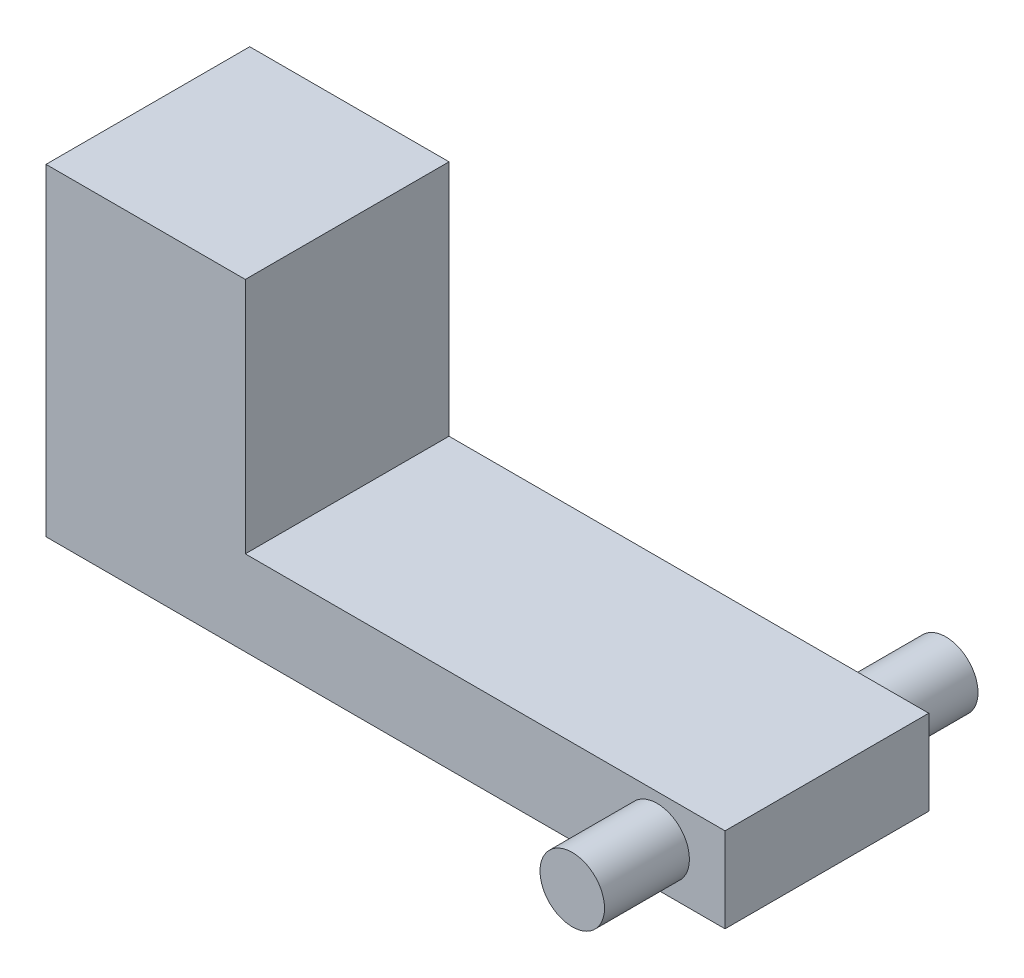
ISO-10303-21;
HEADER;
FILE_DESCRIPTION(('STEP AP214'),'2;1');
FILE_NAME('part.step','',(''),(''),'','','');
FILE_SCHEMA(('AUTOMOTIVE_DESIGN { 1 0 10303 214 1 1 1 1 }'));
ENDSEC;
DATA;
#1=APPLICATION_CONTEXT('core data for automotive mechanical design processes');
#2=APPLICATION_PROTOCOL_DEFINITION('international standard','automotive_design',2000,#1);
#3=PRODUCT_CONTEXT('',#1,'mechanical');
#4=PRODUCT('Part','Part','',(#3));
#5=PRODUCT_RELATED_PRODUCT_CATEGORY('part','',(#4));
#6=PRODUCT_DEFINITION_FORMATION('','',#4);
#7=PRODUCT_DEFINITION_CONTEXT('part definition',#1,'design');
#8=PRODUCT_DEFINITION('design','',#6,#7);
#9=PRODUCT_DEFINITION_SHAPE('','',#8);
#10=(LENGTH_UNIT() NAMED_UNIT(*) SI_UNIT(.MILLI.,.METRE.));
#11=(NAMED_UNIT(*) PLANE_ANGLE_UNIT() SI_UNIT($,.RADIAN.));
#12=(NAMED_UNIT(*) SI_UNIT($,.STERADIAN.) SOLID_ANGLE_UNIT());
#13=UNCERTAINTY_MEASURE_WITH_UNIT(LENGTH_MEASURE(1.E-05),#10,'distance_accuracy_value','');
#14=(GEOMETRIC_REPRESENTATION_CONTEXT(3) GLOBAL_UNCERTAINTY_ASSIGNED_CONTEXT((#13)) GLOBAL_UNIT_ASSIGNED_CONTEXT((#10,
#11,#12)) REPRESENTATION_CONTEXT('',''));
#15=CARTESIAN_POINT('',(0.,0.,0.));
#16=DIRECTION('',(0.,0.,1.));
#17=DIRECTION('',(1.,0.,0.));
#18=AXIS2_PLACEMENT_3D('',#15,#16,#17);
#19=CARTESIAN_POINT('',(0.,2.5,0.));
#20=DIRECTION('',(0.,-1.,0.));
#21=DIRECTION('',(0.,0.,-1.));
#22=AXIS2_PLACEMENT_3D('',#19,#20,#21);
#23=PLANE('',#22);
#24=DIRECTION('',(0.,0.,-1.));
#25=VECTOR('',#24,1.);
#26=CARTESIAN_POINT('',(-4.13008694887129,2.5,3.));
#27=LINE('',#26,#25);
#28=CARTESIAN_POINT('',(-4.13008694887129,2.5,3.));
#29=VERTEX_POINT('',#28);
#30=CARTESIAN_POINT('',(-4.13008694887129,2.5,-3.));
#31=VERTEX_POINT('',#30);
#32=EDGE_CURVE('E49',#29,#31,#27,.T.);
#33=ORIENTED_EDGE('',*,*,#32,.F.);
#34=DIRECTION('',(1.,0.,0.));
#35=VECTOR('',#34,1.);
#36=CARTESIAN_POINT('',(-10.,2.5,3.));
#37=LINE('',#36,#35);
#38=CARTESIAN_POINT('',(10.,2.5,3.));
#39=VERTEX_POINT('',#38);
#40=EDGE_CURVE('E54',#29,#39,#37,.T.);
#41=ORIENTED_EDGE('',*,*,#40,.T.);
#42=DIRECTION('',(0.,0.,-1.));
#43=VECTOR('',#42,1.);
#44=CARTESIAN_POINT('',(10.,2.5,3.));
#45=LINE('',#44,#43);
#46=CARTESIAN_POINT('',(10.,2.5,-3.));
#47=VERTEX_POINT('',#46);
#48=EDGE_CURVE('E85',#39,#47,#45,.T.);
#49=ORIENTED_EDGE('',*,*,#48,.T.);
#50=DIRECTION('',(-1.,0.,0.));
#51=VECTOR('',#50,1.);
#52=CARTESIAN_POINT('',(-10.,2.5,-3.));
#53=LINE('',#52,#51);
#54=EDGE_CURVE('E145',#47,#31,#53,.T.);
#55=ORIENTED_EDGE('',*,*,#54,.T.);
#56=EDGE_LOOP('',(#33,#41,#49,#55));
#57=FACE_BOUND('',#56,.T.);
#58=ADVANCED_FACE('F33',(#57),#23,.F.);
#59=CARTESIAN_POINT('',(10.,2.5,3.));
#60=DIRECTION('',(-1.,0.,0.));
#61=DIRECTION('',(0.,0.,1.));
#62=AXIS2_PLACEMENT_3D('',#59,#60,#61);
#63=PLANE('',#62);
#64=DIRECTION('',(0.,0.,-1.));
#65=VECTOR('',#64,1.);
#66=CARTESIAN_POINT('',(10.,0.,3.));
#67=LINE('',#66,#65);
#68=CARTESIAN_POINT('',(10.,0.,3.));
#69=VERTEX_POINT('',#68);
#70=CARTESIAN_POINT('',(10.,0.,-3.));
#71=VERTEX_POINT('',#70);
#72=EDGE_CURVE('E91',#69,#71,#67,.T.);
#73=ORIENTED_EDGE('',*,*,#72,.T.);
#74=DIRECTION('',(0.,-1.,0.));
#75=VECTOR('',#74,1.);
#76=CARTESIAN_POINT('',(10.,2.5,-3.));
#77=LINE('',#76,#75);
#78=EDGE_CURVE('E11',#47,#71,#77,.T.);
#79=ORIENTED_EDGE('',*,*,#78,.F.);
#80=ORIENTED_EDGE('',*,*,#48,.F.);
#81=DIRECTION('',(0.,-1.,0.));
#82=VECTOR('',#81,1.);
#83=CARTESIAN_POINT('',(10.,2.5,3.));
#84=LINE('',#83,#82);
#85=EDGE_CURVE('E77',#39,#69,#84,.T.);
#86=ORIENTED_EDGE('',*,*,#85,.T.);
#87=EDGE_LOOP('',(#73,#79,#80,#86));
#88=FACE_BOUND('',#87,.T.);
#89=ADVANCED_FACE('F35',(#88),#63,.F.);
#90=CARTESIAN_POINT('',(-10.,2.5,-3.));
#91=DIRECTION('',(0.,0.,1.));
#92=DIRECTION('',(1.,0.,0.));
#93=AXIS2_PLACEMENT_3D('',#90,#91,#92);
#94=PLANE('',#93);
#95=CARTESIAN_POINT('',(8.,1.25,-3.));
#96=DIRECTION('',(0.,0.,1.));
#97=DIRECTION('',(1.,0.,0.));
#98=AXIS2_PLACEMENT_3D('',#95,#96,#97);
#99=CIRCLE('',#98,0.949999999999999);
#100=CARTESIAN_POINT('',(8.95,1.25,-3.));
#101=VERTEX_POINT('',#100);
#102=EDGE_CURVE('E95',#101,#101,#99,.T.);
#103=ORIENTED_EDGE('',*,*,#102,.T.);
#104=EDGE_LOOP('',(#103));
#105=FACE_BOUND('',#104,.T.);
#106=DIRECTION('',(-1.,0.,0.));
#107=VECTOR('',#106,1.);
#108=CARTESIAN_POINT('',(-10.,0.,-3.));
#109=LINE('',#108,#107);
#110=CARTESIAN_POINT('',(-10.,0.,-3.));
#111=VERTEX_POINT('',#110);
#112=EDGE_CURVE('E94',#71,#111,#109,.T.);
#113=ORIENTED_EDGE('',*,*,#112,.T.);
#114=DIRECTION('',(0.,-1.,0.));
#115=VECTOR('',#114,1.);
#116=CARTESIAN_POINT('',(-10.,2.5,-3.));
#117=LINE('',#116,#115);
#118=CARTESIAN_POINT('',(-10.,9.5,-3.));
#119=VERTEX_POINT('',#118);
#120=EDGE_CURVE('E42',#119,#111,#117,.T.);
#121=ORIENTED_EDGE('',*,*,#120,.F.);
#122=DIRECTION('',(-1.,0.,0.));
#123=VECTOR('',#122,1.);
#124=CARTESIAN_POINT('',(-10.,9.5,-3.));
#125=LINE('',#124,#123);
#126=CARTESIAN_POINT('',(-4.13008694887129,9.5,-3.));
#127=VERTEX_POINT('',#126);
#128=EDGE_CURVE('E118',#127,#119,#125,.T.);
#129=ORIENTED_EDGE('',*,*,#128,.F.);
#130=DIRECTION('',(0.,-1.,0.));
#131=VECTOR('',#130,1.);
#132=CARTESIAN_POINT('',(-4.13008694887129,9.5,-3.));
#133=LINE('',#132,#131);
#134=EDGE_CURVE('E128',#127,#31,#133,.T.);
#135=ORIENTED_EDGE('',*,*,#134,.T.);
#136=ORIENTED_EDGE('',*,*,#54,.F.);
#137=ORIENTED_EDGE('',*,*,#78,.T.);
#138=EDGE_LOOP('',(#113,#121,#129,#135,#136,#137));
#139=FACE_BOUND('',#138,.T.);
#140=ADVANCED_FACE('F115',(#105,#139),#94,.F.);
#141=CARTESIAN_POINT('',(-10.,2.5,3.));
#142=DIRECTION('',(1.,0.,0.));
#143=DIRECTION('',(0.,0.,-1.));
#144=AXIS2_PLACEMENT_3D('',#141,#142,#143);
#145=PLANE('',#144);
#146=DIRECTION('',(0.,0.,1.));
#147=VECTOR('',#146,1.);
#148=CARTESIAN_POINT('',(-10.,0.,3.));
#149=LINE('',#148,#147);
#150=CARTESIAN_POINT('',(-10.,0.,3.));
#151=VERTEX_POINT('',#150);
#152=EDGE_CURVE('E86',#111,#151,#149,.T.);
#153=ORIENTED_EDGE('',*,*,#152,.T.);
#154=DIRECTION('',(0.,-1.,0.));
#155=VECTOR('',#154,1.);
#156=CARTESIAN_POINT('',(-10.,2.5,3.));
#157=LINE('',#156,#155);
#158=CARTESIAN_POINT('',(-10.,9.5,3.));
#159=VERTEX_POINT('',#158);
#160=EDGE_CURVE('E81',#159,#151,#157,.T.);
#161=ORIENTED_EDGE('',*,*,#160,.F.);
#162=DIRECTION('',(0.,0.,1.));
#163=VECTOR('',#162,1.);
#164=CARTESIAN_POINT('',(-10.,9.5,3.));
#165=LINE('',#164,#163);
#166=EDGE_CURVE('E111',#119,#159,#165,.T.);
#167=ORIENTED_EDGE('',*,*,#166,.F.);
#168=ORIENTED_EDGE('',*,*,#120,.T.);
#169=EDGE_LOOP('',(#153,#161,#167,#168));
#170=FACE_BOUND('',#169,.T.);
#171=ADVANCED_FACE('F109',(#170),#145,.F.);
#172=CARTESIAN_POINT('',(-10.,2.5,3.));
#173=DIRECTION('',(0.,0.,-1.));
#174=DIRECTION('',(-1.,0.,0.));
#175=AXIS2_PLACEMENT_3D('',#172,#173,#174);
#176=PLANE('',#175);
#177=CARTESIAN_POINT('',(8.,1.25,3.));
#178=DIRECTION('',(0.,0.,-1.));
#179=DIRECTION('',(-1.,0.,0.));
#180=AXIS2_PLACEMENT_3D('',#177,#178,#179);
#181=CIRCLE('',#180,0.949999999999999);
#182=CARTESIAN_POINT('',(7.05,1.25,3.));
#183=VERTEX_POINT('',#182);
#184=EDGE_CURVE('E37',#183,#183,#181,.T.);
#185=ORIENTED_EDGE('',*,*,#184,.T.);
#186=EDGE_LOOP('',(#185));
#187=FACE_BOUND('',#186,.T.);
#188=DIRECTION('',(1.,0.,0.));
#189=VECTOR('',#188,1.);
#190=CARTESIAN_POINT('',(-10.,0.,3.));
#191=LINE('',#190,#189);
#192=EDGE_CURVE('E74',#151,#69,#191,.T.);
#193=ORIENTED_EDGE('',*,*,#192,.T.);
#194=ORIENTED_EDGE('',*,*,#85,.F.);
#195=ORIENTED_EDGE('',*,*,#40,.F.);
#196=DIRECTION('',(0.,-1.,0.));
#197=VECTOR('',#196,1.);
#198=CARTESIAN_POINT('',(-4.13008694887129,9.5,3.));
#199=LINE('',#198,#197);
#200=CARTESIAN_POINT('',(-4.13008694887129,9.5,3.));
#201=VERTEX_POINT('',#200);
#202=EDGE_CURVE('E130',#201,#29,#199,.T.);
#203=ORIENTED_EDGE('',*,*,#202,.F.);
#204=DIRECTION('',(1.,0.,0.));
#205=VECTOR('',#204,1.);
#206=CARTESIAN_POINT('',(-10.,9.5,3.));
#207=LINE('',#206,#205);
#208=EDGE_CURVE('E132',#159,#201,#207,.T.);
#209=ORIENTED_EDGE('',*,*,#208,.F.);
#210=ORIENTED_EDGE('',*,*,#160,.T.);
#211=EDGE_LOOP('',(#193,#194,#195,#203,#209,#210));
#212=FACE_BOUND('',#211,.T.);
#213=ADVANCED_FACE('F76',(#187,#212),#176,.F.);
#214=CARTESIAN_POINT('',(0.,0.,0.));
#215=DIRECTION('',(0.,-1.,0.));
#216=DIRECTION('',(0.,0.,-1.));
#217=AXIS2_PLACEMENT_3D('',#214,#215,#216);
#218=PLANE('',#217);
#219=ORIENTED_EDGE('',*,*,#72,.F.);
#220=ORIENTED_EDGE('',*,*,#192,.F.);
#221=ORIENTED_EDGE('',*,*,#152,.F.);
#222=ORIENTED_EDGE('',*,*,#112,.F.);
#223=EDGE_LOOP('',(#219,#220,#221,#222));
#224=FACE_BOUND('',#223,.T.);
#225=ADVANCED_FACE('F93',(#224),#218,.T.);
#226=CARTESIAN_POINT('',(8.,1.25,5.5));
#227=DIRECTION('',(0.,0.,1.));
#228=DIRECTION('',(1.,0.,0.));
#229=AXIS2_PLACEMENT_3D('',#226,#227,#228);
#230=PLANE('',#229);
#231=CARTESIAN_POINT('',(8.,1.25,5.5));
#232=DIRECTION('',(0.,0.,1.));
#233=DIRECTION('',(1.,0.,0.));
#234=AXIS2_PLACEMENT_3D('',#231,#232,#233);
#235=CIRCLE('',#234,0.949999999999999);
#236=CARTESIAN_POINT('',(8.95,1.25,5.5));
#237=VERTEX_POINT('',#236);
#238=EDGE_CURVE('E139',#237,#237,#235,.T.);
#239=ORIENTED_EDGE('',*,*,#238,.T.);
#240=EDGE_LOOP('',(#239));
#241=FACE_BOUND('',#240,.T.);
#242=ADVANCED_FACE('F176',(#241),#230,.T.);
#243=CARTESIAN_POINT('',(8.,1.25,-5.5));
#244=DIRECTION('',(0.,0.,1.));
#245=DIRECTION('',(1.,0.,0.));
#246=AXIS2_PLACEMENT_3D('',#243,#244,#245);
#247=CYLINDRICAL_SURFACE('',#246,0.949999999999999);
#248=ORIENTED_EDGE('',*,*,#238,.F.);
#249=EDGE_LOOP('',(#248));
#250=FACE_BOUND('',#249,.T.);
#251=ORIENTED_EDGE('',*,*,#184,.F.);
#252=EDGE_LOOP('',(#251));
#253=FACE_BOUND('',#252,.T.);
#254=ADVANCED_FACE('F188',(#250,#253),#247,.T.);
#255=CARTESIAN_POINT('',(8.,1.25,-5.5));
#256=DIRECTION('',(0.,0.,1.));
#257=DIRECTION('',(1.,0.,0.));
#258=AXIS2_PLACEMENT_3D('',#255,#256,#257);
#259=CIRCLE('',#258,0.949999999999999);
#260=CARTESIAN_POINT('',(8.95,1.25,-5.5));
#261=VERTEX_POINT('',#260);
#262=EDGE_CURVE('E142',#261,#261,#259,.T.);
#263=ORIENTED_EDGE('',*,*,#262,.T.);
#264=EDGE_LOOP('',(#263));
#265=FACE_BOUND('',#264,.T.);
#266=ORIENTED_EDGE('',*,*,#102,.F.);
#267=EDGE_LOOP('',(#266));
#268=FACE_BOUND('',#267,.T.);
#269=ADVANCED_FACE('F163',(#265,#268),#247,.T.);
#270=CARTESIAN_POINT('',(8.,1.25,-5.5));
#271=DIRECTION('',(0.,0.,1.));
#272=DIRECTION('',(1.,0.,0.));
#273=AXIS2_PLACEMENT_3D('',#270,#271,#272);
#274=PLANE('',#273);
#275=ORIENTED_EDGE('',*,*,#262,.F.);
#276=EDGE_LOOP('',(#275));
#277=FACE_BOUND('',#276,.T.);
#278=ADVANCED_FACE('F156',(#277),#274,.F.);
#279=CARTESIAN_POINT('',(-4.13008694887129,9.5,3.));
#280=DIRECTION('',(-1.,0.,0.));
#281=DIRECTION('',(0.,0.,1.));
#282=AXIS2_PLACEMENT_3D('',#279,#280,#281);
#283=PLANE('',#282);
#284=ORIENTED_EDGE('',*,*,#32,.T.);
#285=ORIENTED_EDGE('',*,*,#134,.F.);
#286=DIRECTION('',(0.,0.,-1.));
#287=VECTOR('',#286,1.);
#288=CARTESIAN_POINT('',(-4.13008694887129,9.5,3.));
#289=LINE('',#288,#287);
#290=EDGE_CURVE('E126',#201,#127,#289,.T.);
#291=ORIENTED_EDGE('',*,*,#290,.F.);
#292=ORIENTED_EDGE('',*,*,#202,.T.);
#293=EDGE_LOOP('',(#284,#285,#291,#292));
#294=FACE_BOUND('',#293,.T.);
#295=ADVANCED_FACE('F148',(#294),#283,.F.);
#296=CARTESIAN_POINT('',(0.,9.5,0.));
#297=DIRECTION('',(0.,-1.,0.));
#298=DIRECTION('',(0.,0.,-1.));
#299=AXIS2_PLACEMENT_3D('',#296,#297,#298);
#300=PLANE('',#299);
#301=ORIENTED_EDGE('',*,*,#166,.T.);
#302=ORIENTED_EDGE('',*,*,#208,.T.);
#303=ORIENTED_EDGE('',*,*,#290,.T.);
#304=ORIENTED_EDGE('',*,*,#128,.T.);
#305=EDGE_LOOP('',(#301,#302,#303,#304));
#306=FACE_BOUND('',#305,.T.);
#307=ADVANCED_FACE('F122',(#306),#300,.F.);
#308=CLOSED_SHELL('',(#58,#89,#140,#171,#213,#225,#242,#254,#269,#278,#295,#307));
#309=MANIFOLD_SOLID_BREP('B2',#308);
#310=ADVANCED_BREP_SHAPE_REPRESENTATION('',(#18,#309),#14);
#311=SHAPE_DEFINITION_REPRESENTATION(#9,#310);
ENDSEC;
END-ISO-10303-21;
